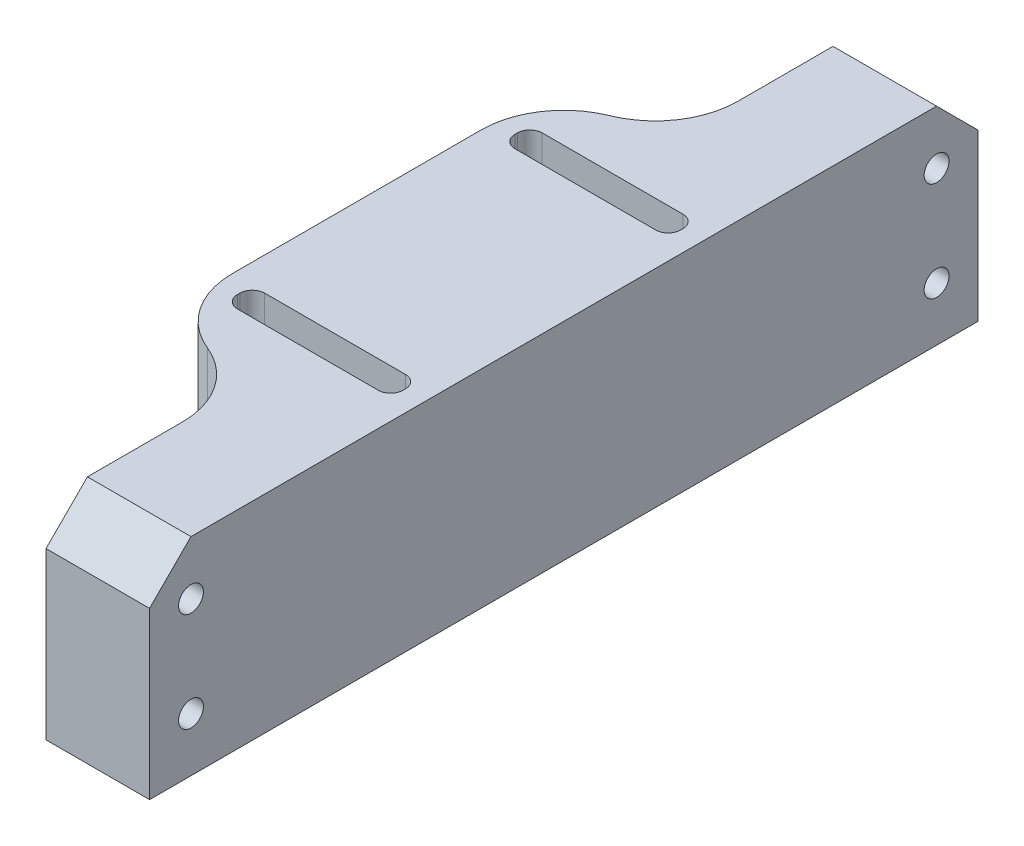
ISO-10303-21;
HEADER;
FILE_DESCRIPTION(('STEP AP214'),'2;1');
FILE_NAME('part.step','',(''),(''),'','','');
FILE_SCHEMA(('AUTOMOTIVE_DESIGN { 1 0 10303 214 1 1 1 1 }'));
ENDSEC;
DATA;
#1=APPLICATION_CONTEXT('core data for automotive mechanical design processes');
#2=APPLICATION_PROTOCOL_DEFINITION('international standard','automotive_design',2000,#1);
#3=PRODUCT_CONTEXT('',#1,'mechanical');
#4=PRODUCT('Part','Part','',(#3));
#5=PRODUCT_RELATED_PRODUCT_CATEGORY('part','',(#4));
#6=PRODUCT_DEFINITION_FORMATION('','',#4);
#7=PRODUCT_DEFINITION_CONTEXT('part definition',#1,'design');
#8=PRODUCT_DEFINITION('design','',#6,#7);
#9=PRODUCT_DEFINITION_SHAPE('','',#8);
#10=(LENGTH_UNIT() NAMED_UNIT(*) SI_UNIT(.MILLI.,.METRE.));
#11=(NAMED_UNIT(*) PLANE_ANGLE_UNIT() SI_UNIT($,.RADIAN.));
#12=(NAMED_UNIT(*) SI_UNIT($,.STERADIAN.) SOLID_ANGLE_UNIT());
#13=UNCERTAINTY_MEASURE_WITH_UNIT(LENGTH_MEASURE(1.E-05),#10,'distance_accuracy_value','');
#14=(GEOMETRIC_REPRESENTATION_CONTEXT(3) GLOBAL_UNCERTAINTY_ASSIGNED_CONTEXT((#13)) GLOBAL_UNIT_ASSIGNED_CONTEXT((#10,
#11,#12)) REPRESENTATION_CONTEXT('',''));
#15=CARTESIAN_POINT('',(0.,0.,0.));
#16=DIRECTION('',(0.,0.,1.));
#17=DIRECTION('',(1.,0.,0.));
#18=AXIS2_PLACEMENT_3D('',#15,#16,#17);
#19=CARTESIAN_POINT('',(0.,25.,0.));
#20=DIRECTION('',(0.,-1.,0.));
#21=DIRECTION('',(0.,0.,-1.));
#22=AXIS2_PLACEMENT_3D('',#19,#20,#21);
#23=PLANE('',#22);
#24=DIRECTION('',(0.,0.,1.));
#25=VECTOR('',#24,1.);
#26=CARTESIAN_POINT('',(-10.,25.,-15.1));
#27=LINE('',#26,#25);
#28=CARTESIAN_POINT('',(-10.,25.,-16.9));
#29=VERTEX_POINT('',#28);
#30=CARTESIAN_POINT('',(-10.,25.,-16.6));
#31=VERTEX_POINT('',#30);
#32=EDGE_CURVE('E428',#29,#31,#27,.T.);
#33=ORIENTED_EDGE('',*,*,#32,.F.);
#34=CARTESIAN_POINT('',(-8.5,25.,-16.9));
#35=DIRECTION('',(0.,-1.,0.));
#36=DIRECTION('',(0.,0.,-1.));
#37=AXIS2_PLACEMENT_3D('',#34,#35,#36);
#38=CIRCLE('',#37,1.5);
#39=CARTESIAN_POINT('',(-8.5,25.,-18.4));
#40=VERTEX_POINT('',#39);
#41=EDGE_CURVE('E347',#29,#40,#38,.T.);
#42=ORIENTED_EDGE('',*,*,#41,.T.);
#43=DIRECTION('',(-1.,0.,0.));
#44=VECTOR('',#43,1.);
#45=CARTESIAN_POINT('',(10.,25.,-18.4));
#46=LINE('',#45,#44);
#47=CARTESIAN_POINT('',(8.5,25.,-18.4));
#48=VERTEX_POINT('',#47);
#49=EDGE_CURVE('E406',#48,#40,#46,.T.);
#50=ORIENTED_EDGE('',*,*,#49,.F.);
#51=CARTESIAN_POINT('',(8.5,25.,-16.9));
#52=DIRECTION('',(0.,-1.,0.));
#53=DIRECTION('',(0.,0.,-1.));
#54=AXIS2_PLACEMENT_3D('',#51,#52,#53);
#55=CIRCLE('',#54,1.5);
#56=CARTESIAN_POINT('',(10.,25.,-16.9));
#57=VERTEX_POINT('',#56);
#58=EDGE_CURVE('E339',#48,#57,#55,.T.);
#59=ORIENTED_EDGE('',*,*,#58,.T.);
#60=DIRECTION('',(0.,0.,-1.));
#61=VECTOR('',#60,1.);
#62=CARTESIAN_POINT('',(10.,25.,-15.1));
#63=LINE('',#62,#61);
#64=CARTESIAN_POINT('',(10.,25.,-16.6));
#65=VERTEX_POINT('',#64);
#66=EDGE_CURVE('E408',#65,#57,#63,.T.);
#67=ORIENTED_EDGE('',*,*,#66,.F.);
#68=CARTESIAN_POINT('',(8.5,25.,-16.6));
#69=DIRECTION('',(0.,-1.,0.));
#70=DIRECTION('',(0.,0.,-1.));
#71=AXIS2_PLACEMENT_3D('',#68,#69,#70);
#72=CIRCLE('',#71,1.5);
#73=CARTESIAN_POINT('',(8.5,25.,-15.1));
#74=VERTEX_POINT('',#73);
#75=EDGE_CURVE('E335',#65,#74,#72,.T.);
#76=ORIENTED_EDGE('',*,*,#75,.T.);
#77=DIRECTION('',(1.,0.,0.));
#78=VECTOR('',#77,1.);
#79=CARTESIAN_POINT('',(10.,25.,-15.1));
#80=LINE('',#79,#78);
#81=CARTESIAN_POINT('',(-8.5,25.,-15.1));
#82=VERTEX_POINT('',#81);
#83=EDGE_CURVE('E414',#82,#74,#80,.T.);
#84=ORIENTED_EDGE('',*,*,#83,.F.);
#85=CARTESIAN_POINT('',(-8.5,25.,-16.6));
#86=DIRECTION('',(0.,-1.,0.));
#87=DIRECTION('',(0.,0.,-1.));
#88=AXIS2_PLACEMENT_3D('',#85,#86,#87);
#89=CIRCLE('',#88,1.5);
#90=EDGE_CURVE('E343',#82,#31,#89,.T.);
#91=ORIENTED_EDGE('',*,*,#90,.T.);
#92=EDGE_LOOP('',(#33,#42,#50,#59,#67,#76,#84,#91));
#93=FACE_BOUND('',#92,.T.);
#94=CARTESIAN_POINT('',(-2.5,25.,15.));
#95=DIRECTION('',(0.,-1.,0.));
#96=DIRECTION('',(0.,0.,-1.));
#97=AXIS2_PLACEMENT_3D('',#94,#95,#96);
#98=CIRCLE('',#97,10.);
#99=CARTESIAN_POINT('',(-12.5,25.,15.));
#100=VERTEX_POINT('',#99);
#101=CARTESIAN_POINT('',(-6.25,25.,24.2702481088696));
#102=VERTEX_POINT('',#101);
#103=EDGE_CURVE('E274',#100,#102,#98,.F.);
#104=ORIENTED_EDGE('',*,*,#103,.T.);
#105=CARTESIAN_POINT('',(-9.99999999999999,25.,33.5404962177392));
#106=DIRECTION('',(0.,-1.,0.));
#107=DIRECTION('',(0.,0.,-1.));
#108=AXIS2_PLACEMENT_3D('',#105,#106,#107);
#109=CIRCLE('',#108,10.);
#110=CARTESIAN_POINT('',(0.,25.,33.5404962177392));
#111=VERTEX_POINT('',#110);
#112=EDGE_CURVE('E375',#102,#111,#109,.T.);
#113=ORIENTED_EDGE('',*,*,#112,.T.);
#114=DIRECTION('',(0.,0.,1.));
#115=VECTOR('',#114,1.);
#116=CARTESIAN_POINT('',(0.,25.,25.));
#117=LINE('',#116,#115);
#118=CARTESIAN_POINT('',(0.,25.,45.));
#119=VERTEX_POINT('',#118);
#120=EDGE_CURVE('E379',#111,#119,#117,.T.);
#121=ORIENTED_EDGE('',*,*,#120,.T.);
#122=DIRECTION('',(1.,0.,0.));
#123=VECTOR('',#122,1.);
#124=CARTESIAN_POINT('',(0.,25.,45.));
#125=LINE('',#124,#123);
#126=CARTESIAN_POINT('',(12.5,25.,45.));
#127=VERTEX_POINT('',#126);
#128=EDGE_CURVE('E352',#119,#127,#125,.T.);
#129=ORIENTED_EDGE('',*,*,#128,.T.);
#130=DIRECTION('',(0.,0.,-1.));
#131=VECTOR('',#130,1.);
#132=CARTESIAN_POINT('',(12.5,25.,50.));
#133=LINE('',#132,#131);
#134=CARTESIAN_POINT('',(12.5,25.,-45.));
#135=VERTEX_POINT('',#134);
#136=EDGE_CURVE('E385',#127,#135,#133,.T.);
#137=ORIENTED_EDGE('',*,*,#136,.T.);
#138=DIRECTION('',(-1.,0.,0.));
#139=VECTOR('',#138,1.);
#140=CARTESIAN_POINT('',(0.,25.,-45.));
#141=LINE('',#140,#139);
#142=CARTESIAN_POINT('',(0.,25.,-45.));
#143=VERTEX_POINT('',#142);
#144=EDGE_CURVE('E349',#135,#143,#141,.T.);
#145=ORIENTED_EDGE('',*,*,#144,.T.);
#146=DIRECTION('',(0.,0.,1.));
#147=VECTOR('',#146,1.);
#148=CARTESIAN_POINT('',(0.,25.,-25.));
#149=LINE('',#148,#147);
#150=CARTESIAN_POINT('',(0.,25.,-33.5404962177392));
#151=VERTEX_POINT('',#150);
#152=EDGE_CURVE('E261',#143,#151,#149,.T.);
#153=ORIENTED_EDGE('',*,*,#152,.T.);
#154=CARTESIAN_POINT('',(-9.99999999999999,25.,-33.5404962177392));
#155=DIRECTION('',(0.,-1.,0.));
#156=DIRECTION('',(0.,0.,-1.));
#157=AXIS2_PLACEMENT_3D('',#154,#155,#156);
#158=CIRCLE('',#157,10.);
#159=CARTESIAN_POINT('',(-6.25,25.,-24.2702481088696));
#160=VERTEX_POINT('',#159);
#161=EDGE_CURVE('E11',#151,#160,#158,.T.);
#162=ORIENTED_EDGE('',*,*,#161,.T.);
#163=CARTESIAN_POINT('',(-2.5,25.,-15.));
#164=DIRECTION('',(0.,-1.,0.));
#165=DIRECTION('',(0.,0.,-1.));
#166=AXIS2_PLACEMENT_3D('',#163,#164,#165);
#167=CIRCLE('',#166,10.);
#168=CARTESIAN_POINT('',(-12.5,25.,-15.));
#169=VERTEX_POINT('',#168);
#170=EDGE_CURVE('E272',#160,#169,#167,.F.);
#171=ORIENTED_EDGE('',*,*,#170,.T.);
#172=DIRECTION('',(0.,0.,1.));
#173=VECTOR('',#172,1.);
#174=CARTESIAN_POINT('',(-12.5,25.,25.));
#175=LINE('',#174,#173);
#176=EDGE_CURVE('E257',#169,#100,#175,.T.);
#177=ORIENTED_EDGE('',*,*,#176,.T.);
#178=EDGE_LOOP('',(#104,#113,#121,#129,#137,#145,#153,#162,#171,#177));
#179=FACE_BOUND('',#178,.T.);
#180=DIRECTION('',(0.,0.,1.));
#181=VECTOR('',#180,1.);
#182=CARTESIAN_POINT('',(-10.,25.,18.4));
#183=LINE('',#182,#181);
#184=CARTESIAN_POINT('',(-10.,25.,16.6));
#185=VERTEX_POINT('',#184);
#186=CARTESIAN_POINT('',(-10.,25.,16.9));
#187=VERTEX_POINT('',#186);
#188=EDGE_CURVE('E440',#185,#187,#183,.T.);
#189=ORIENTED_EDGE('',*,*,#188,.F.);
#190=CARTESIAN_POINT('',(-8.50000000000001,25.,16.6));
#191=DIRECTION('',(0.,-1.,0.));
#192=DIRECTION('',(0.,0.,-1.));
#193=AXIS2_PLACEMENT_3D('',#190,#191,#192);
#194=CIRCLE('',#193,1.5);
#195=CARTESIAN_POINT('',(-8.50000000000001,25.,15.1));
#196=VERTEX_POINT('',#195);
#197=EDGE_CURVE('E323',#185,#196,#194,.T.);
#198=ORIENTED_EDGE('',*,*,#197,.T.);
#199=DIRECTION('',(-1.,0.,0.));
#200=VECTOR('',#199,1.);
#201=CARTESIAN_POINT('',(9.99999999999999,25.,15.1));
#202=LINE('',#201,#200);
#203=CARTESIAN_POINT('',(8.49999999999999,25.,15.1));
#204=VERTEX_POINT('',#203);
#205=EDGE_CURVE('E422',#204,#196,#202,.T.);
#206=ORIENTED_EDGE('',*,*,#205,.F.);
#207=CARTESIAN_POINT('',(8.49999999999999,25.,16.6));
#208=DIRECTION('',(0.,-1.,0.));
#209=DIRECTION('',(0.,0.,-1.));
#210=AXIS2_PLACEMENT_3D('',#207,#208,#209);
#211=CIRCLE('',#210,1.5);
#212=CARTESIAN_POINT('',(9.99999999999999,25.,16.6));
#213=VERTEX_POINT('',#212);
#214=EDGE_CURVE('E327',#204,#213,#211,.T.);
#215=ORIENTED_EDGE('',*,*,#214,.T.);
#216=DIRECTION('',(0.,0.,-1.));
#217=VECTOR('',#216,1.);
#218=CARTESIAN_POINT('',(9.99999999999999,25.,18.4));
#219=LINE('',#218,#217);
#220=CARTESIAN_POINT('',(9.99999999999999,25.,16.9));
#221=VERTEX_POINT('',#220);
#222=EDGE_CURVE('E453',#221,#213,#219,.T.);
#223=ORIENTED_EDGE('',*,*,#222,.F.);
#224=CARTESIAN_POINT('',(8.49999999999999,25.,16.9));
#225=DIRECTION('',(0.,-1.,0.));
#226=DIRECTION('',(0.,0.,-1.));
#227=AXIS2_PLACEMENT_3D('',#224,#225,#226);
#228=CIRCLE('',#227,1.5);
#229=CARTESIAN_POINT('',(8.49999999999999,25.,18.4));
#230=VERTEX_POINT('',#229);
#231=EDGE_CURVE('E331',#221,#230,#228,.T.);
#232=ORIENTED_EDGE('',*,*,#231,.T.);
#233=DIRECTION('',(1.,0.,0.));
#234=VECTOR('',#233,1.);
#235=CARTESIAN_POINT('',(9.99999999999999,25.,18.4));
#236=LINE('',#235,#234);
#237=CARTESIAN_POINT('',(-8.50000000000001,25.,18.4));
#238=VERTEX_POINT('',#237);
#239=EDGE_CURVE('E456',#238,#230,#236,.T.);
#240=ORIENTED_EDGE('',*,*,#239,.F.);
#241=CARTESIAN_POINT('',(-8.50000000000001,25.,16.9));
#242=DIRECTION('',(0.,-1.,0.));
#243=DIRECTION('',(0.,0.,-1.));
#244=AXIS2_PLACEMENT_3D('',#241,#242,#243);
#245=CIRCLE('',#244,1.5);
#246=EDGE_CURVE('E319',#238,#187,#245,.T.);
#247=ORIENTED_EDGE('',*,*,#246,.T.);
#248=EDGE_LOOP('',(#189,#198,#206,#215,#223,#232,#240,#247));
#249=FACE_BOUND('',#248,.T.);
#250=ADVANCED_FACE('F34',(#93,#179,#249),#23,.F.);
#251=CARTESIAN_POINT('',(0.,0.,0.));
#252=DIRECTION('',(0.,-1.,0.));
#253=DIRECTION('',(0.,0.,-1.));
#254=AXIS2_PLACEMENT_3D('',#251,#252,#253);
#255=PLANE('',#254);
#256=DIRECTION('',(0.,0.,1.));
#257=VECTOR('',#256,1.);
#258=CARTESIAN_POINT('',(0.,0.,25.));
#259=LINE('',#258,#257);
#260=CARTESIAN_POINT('',(0.,0.,33.5404962177392));
#261=VERTEX_POINT('',#260);
#262=CARTESIAN_POINT('',(0.,0.,50.));
#263=VERTEX_POINT('',#262);
#264=EDGE_CURVE('E220',#261,#263,#259,.T.);
#265=ORIENTED_EDGE('',*,*,#264,.F.);
#266=CARTESIAN_POINT('',(-9.99999999999999,0.,33.5404962177392));
#267=DIRECTION('',(0.,-1.,0.));
#268=DIRECTION('',(0.,0.,-1.));
#269=AXIS2_PLACEMENT_3D('',#266,#267,#268);
#270=CIRCLE('',#269,10.);
#271=CARTESIAN_POINT('',(-6.25,0.,24.2702481088696));
#272=VERTEX_POINT('',#271);
#273=EDGE_CURVE('E373',#261,#272,#270,.F.);
#274=ORIENTED_EDGE('',*,*,#273,.T.);
#275=CARTESIAN_POINT('',(-2.5,0.,15.));
#276=DIRECTION('',(0.,-1.,0.));
#277=DIRECTION('',(0.,0.,-1.));
#278=AXIS2_PLACEMENT_3D('',#275,#276,#277);
#279=CIRCLE('',#278,10.);
#280=CARTESIAN_POINT('',(-12.5,0.,15.));
#281=VERTEX_POINT('',#280);
#282=EDGE_CURVE('E265',#272,#281,#279,.T.);
#283=ORIENTED_EDGE('',*,*,#282,.T.);
#284=DIRECTION('',(0.,0.,1.));
#285=VECTOR('',#284,1.);
#286=CARTESIAN_POINT('',(-12.5,0.,25.));
#287=LINE('',#286,#285);
#288=CARTESIAN_POINT('',(-12.5,0.,-15.));
#289=VERTEX_POINT('',#288);
#290=EDGE_CURVE('E231',#289,#281,#287,.T.);
#291=ORIENTED_EDGE('',*,*,#290,.F.);
#292=CARTESIAN_POINT('',(-2.5,0.,-15.));
#293=DIRECTION('',(0.,-1.,0.));
#294=DIRECTION('',(0.,0.,-1.));
#295=AXIS2_PLACEMENT_3D('',#292,#293,#294);
#296=CIRCLE('',#295,10.);
#297=CARTESIAN_POINT('',(-6.25,0.,-24.2702481088696));
#298=VERTEX_POINT('',#297);
#299=EDGE_CURVE('E240',#289,#298,#296,.T.);
#300=ORIENTED_EDGE('',*,*,#299,.T.);
#301=CARTESIAN_POINT('',(-9.99999999999999,0.,-33.5404962177392));
#302=DIRECTION('',(0.,-1.,0.));
#303=DIRECTION('',(0.,0.,-1.));
#304=AXIS2_PLACEMENT_3D('',#301,#302,#303);
#305=CIRCLE('',#304,10.);
#306=CARTESIAN_POINT('',(0.,0.,-33.5404962177392));
#307=VERTEX_POINT('',#306);
#308=EDGE_CURVE('E42',#298,#307,#305,.F.);
#309=ORIENTED_EDGE('',*,*,#308,.T.);
#310=DIRECTION('',(0.,0.,1.));
#311=VECTOR('',#310,1.);
#312=CARTESIAN_POINT('',(0.,0.,-25.));
#313=LINE('',#312,#311);
#314=CARTESIAN_POINT('',(0.,0.,-50.));
#315=VERTEX_POINT('',#314);
#316=EDGE_CURVE('E255',#315,#307,#313,.T.);
#317=ORIENTED_EDGE('',*,*,#316,.F.);
#318=DIRECTION('',(-1.,0.,0.));
#319=VECTOR('',#318,1.);
#320=CARTESIAN_POINT('',(0.,0.,-50.));
#321=LINE('',#320,#319);
#322=CARTESIAN_POINT('',(12.5,0.,-50.));
#323=VERTEX_POINT('',#322);
#324=EDGE_CURVE('E249',#323,#315,#321,.T.);
#325=ORIENTED_EDGE('',*,*,#324,.F.);
#326=DIRECTION('',(0.,0.,-1.));
#327=VECTOR('',#326,1.);
#328=CARTESIAN_POINT('',(12.5,0.,50.));
#329=LINE('',#328,#327);
#330=CARTESIAN_POINT('',(12.5,0.,50.));
#331=VERTEX_POINT('',#330);
#332=EDGE_CURVE('E247',#331,#323,#329,.T.);
#333=ORIENTED_EDGE('',*,*,#332,.F.);
#334=DIRECTION('',(1.,0.,0.));
#335=VECTOR('',#334,1.);
#336=CARTESIAN_POINT('',(0.,0.,50.));
#337=LINE('',#336,#335);
#338=EDGE_CURVE('E230',#263,#331,#337,.T.);
#339=ORIENTED_EDGE('',*,*,#338,.F.);
#340=EDGE_LOOP('',(#265,#274,#283,#291,#300,#309,#317,#325,#333,#339));
#341=FACE_BOUND('',#340,.T.);
#342=DIRECTION('',(0.,0.,-1.));
#343=VECTOR('',#342,1.);
#344=CARTESIAN_POINT('',(10.,0.,-15.1));
#345=LINE('',#344,#343);
#346=CARTESIAN_POINT('',(10.,0.,-16.6));
#347=VERTEX_POINT('',#346);
#348=CARTESIAN_POINT('',(10.,0.,-16.9));
#349=VERTEX_POINT('',#348);
#350=EDGE_CURVE('E424',#347,#349,#345,.T.);
#351=ORIENTED_EDGE('',*,*,#350,.T.);
#352=CARTESIAN_POINT('',(8.5,0.,-16.9));
#353=DIRECTION('',(0.,-1.,0.));
#354=DIRECTION('',(0.,0.,-1.));
#355=AXIS2_PLACEMENT_3D('',#352,#353,#354);
#356=CIRCLE('',#355,1.5);
#357=CARTESIAN_POINT('',(8.5,0.,-18.4));
#358=VERTEX_POINT('',#357);
#359=EDGE_CURVE('E337',#349,#358,#356,.F.);
#360=ORIENTED_EDGE('',*,*,#359,.T.);
#361=DIRECTION('',(-1.,0.,0.));
#362=VECTOR('',#361,1.);
#363=CARTESIAN_POINT('',(10.,0.,-18.4));
#364=LINE('',#363,#362);
#365=CARTESIAN_POINT('',(-8.5,0.,-18.4));
#366=VERTEX_POINT('',#365);
#367=EDGE_CURVE('E401',#358,#366,#364,.T.);
#368=ORIENTED_EDGE('',*,*,#367,.T.);
#369=CARTESIAN_POINT('',(-8.5,0.,-16.9));
#370=DIRECTION('',(0.,-1.,0.));
#371=DIRECTION('',(0.,0.,-1.));
#372=AXIS2_PLACEMENT_3D('',#369,#370,#371);
#373=CIRCLE('',#372,1.5);
#374=CARTESIAN_POINT('',(-10.,0.,-16.9));
#375=VERTEX_POINT('',#374);
#376=EDGE_CURVE('E345',#366,#375,#373,.F.);
#377=ORIENTED_EDGE('',*,*,#376,.T.);
#378=DIRECTION('',(0.,0.,1.));
#379=VECTOR('',#378,1.);
#380=CARTESIAN_POINT('',(-10.,0.,-15.1));
#381=LINE('',#380,#379);
#382=CARTESIAN_POINT('',(-10.,0.,-16.6));
#383=VERTEX_POINT('',#382);
#384=EDGE_CURVE('E418',#375,#383,#381,.T.);
#385=ORIENTED_EDGE('',*,*,#384,.T.);
#386=CARTESIAN_POINT('',(-8.5,0.,-16.6));
#387=DIRECTION('',(0.,-1.,0.));
#388=DIRECTION('',(0.,0.,-1.));
#389=AXIS2_PLACEMENT_3D('',#386,#387,#388);
#390=CIRCLE('',#389,1.5);
#391=CARTESIAN_POINT('',(-8.5,0.,-15.1));
#392=VERTEX_POINT('',#391);
#393=EDGE_CURVE('E341',#383,#392,#390,.F.);
#394=ORIENTED_EDGE('',*,*,#393,.T.);
#395=DIRECTION('',(1.,0.,0.));
#396=VECTOR('',#395,1.);
#397=CARTESIAN_POINT('',(10.,0.,-15.1));
#398=LINE('',#397,#396);
#399=CARTESIAN_POINT('',(8.5,0.,-15.1));
#400=VERTEX_POINT('',#399);
#401=EDGE_CURVE('E421',#392,#400,#398,.T.);
#402=ORIENTED_EDGE('',*,*,#401,.T.);
#403=CARTESIAN_POINT('',(8.5,0.,-16.6));
#404=DIRECTION('',(0.,-1.,0.));
#405=DIRECTION('',(0.,0.,-1.));
#406=AXIS2_PLACEMENT_3D('',#403,#404,#405);
#407=CIRCLE('',#406,1.5);
#408=EDGE_CURVE('E333',#400,#347,#407,.F.);
#409=ORIENTED_EDGE('',*,*,#408,.T.);
#410=EDGE_LOOP('',(#351,#360,#368,#377,#385,#394,#402,#409));
#411=FACE_BOUND('',#410,.T.);
#412=DIRECTION('',(0.,0.,-1.));
#413=VECTOR('',#412,1.);
#414=CARTESIAN_POINT('',(9.99999999999999,0.,18.4));
#415=LINE('',#414,#413);
#416=CARTESIAN_POINT('',(9.99999999999999,0.,16.9));
#417=VERTEX_POINT('',#416);
#418=CARTESIAN_POINT('',(9.99999999999999,0.,16.6));
#419=VERTEX_POINT('',#418);
#420=EDGE_CURVE('E441',#417,#419,#415,.T.);
#421=ORIENTED_EDGE('',*,*,#420,.T.);
#422=CARTESIAN_POINT('',(8.49999999999999,0.,16.6));
#423=DIRECTION('',(0.,-1.,0.));
#424=DIRECTION('',(0.,0.,-1.));
#425=AXIS2_PLACEMENT_3D('',#422,#423,#424);
#426=CIRCLE('',#425,1.5);
#427=CARTESIAN_POINT('',(8.49999999999999,0.,15.1));
#428=VERTEX_POINT('',#427);
#429=EDGE_CURVE('E325',#419,#428,#426,.F.);
#430=ORIENTED_EDGE('',*,*,#429,.T.);
#431=DIRECTION('',(-1.,0.,0.));
#432=VECTOR('',#431,1.);
#433=CARTESIAN_POINT('',(9.99999999999999,0.,15.1));
#434=LINE('',#433,#432);
#435=CARTESIAN_POINT('',(-8.50000000000001,0.,15.1));
#436=VERTEX_POINT('',#435);
#437=EDGE_CURVE('E437',#428,#436,#434,.T.);
#438=ORIENTED_EDGE('',*,*,#437,.T.);
#439=CARTESIAN_POINT('',(-8.50000000000001,0.,16.6));
#440=DIRECTION('',(0.,-1.,0.));
#441=DIRECTION('',(0.,0.,-1.));
#442=AXIS2_PLACEMENT_3D('',#439,#440,#441);
#443=CIRCLE('',#442,1.5);
#444=CARTESIAN_POINT('',(-10.,0.,16.6));
#445=VERTEX_POINT('',#444);
#446=EDGE_CURVE('E321',#436,#445,#443,.F.);
#447=ORIENTED_EDGE('',*,*,#446,.T.);
#448=DIRECTION('',(0.,0.,1.));
#449=VECTOR('',#448,1.);
#450=CARTESIAN_POINT('',(-10.,0.,18.4));
#451=LINE('',#450,#449);
#452=CARTESIAN_POINT('',(-10.,0.,16.9));
#453=VERTEX_POINT('',#452);
#454=EDGE_CURVE('E447',#445,#453,#451,.T.);
#455=ORIENTED_EDGE('',*,*,#454,.T.);
#456=CARTESIAN_POINT('',(-8.50000000000001,0.,16.9));
#457=DIRECTION('',(0.,-1.,0.));
#458=DIRECTION('',(0.,0.,-1.));
#459=AXIS2_PLACEMENT_3D('',#456,#457,#458);
#460=CIRCLE('',#459,1.5);
#461=CARTESIAN_POINT('',(-8.50000000000001,0.,18.4));
#462=VERTEX_POINT('',#461);
#463=EDGE_CURVE('E317',#453,#462,#460,.F.);
#464=ORIENTED_EDGE('',*,*,#463,.T.);
#465=DIRECTION('',(1.,0.,0.));
#466=VECTOR('',#465,1.);
#467=CARTESIAN_POINT('',(9.99999999999999,0.,18.4));
#468=LINE('',#467,#466);
#469=CARTESIAN_POINT('',(8.49999999999999,0.,18.4));
#470=VERTEX_POINT('',#469);
#471=EDGE_CURVE('E444',#462,#470,#468,.T.);
#472=ORIENTED_EDGE('',*,*,#471,.T.);
#473=CARTESIAN_POINT('',(8.49999999999999,0.,16.9));
#474=DIRECTION('',(0.,-1.,0.));
#475=DIRECTION('',(0.,0.,-1.));
#476=AXIS2_PLACEMENT_3D('',#473,#474,#475);
#477=CIRCLE('',#476,1.5);
#478=EDGE_CURVE('E329',#470,#417,#477,.F.);
#479=ORIENTED_EDGE('',*,*,#478,.T.);
#480=EDGE_LOOP('',(#421,#430,#438,#447,#455,#464,#472,#479));
#481=FACE_BOUND('',#480,.T.);
#482=ADVANCED_FACE('F243',(#341,#411,#481),#255,.T.);
#483=CARTESIAN_POINT('',(-12.5,25.,25.));
#484=DIRECTION('',(1.,0.,0.));
#485=DIRECTION('',(0.,0.,-1.));
#486=AXIS2_PLACEMENT_3D('',#483,#484,#485);
#487=PLANE('',#486);
#488=ORIENTED_EDGE('',*,*,#290,.T.);
#489=DIRECTION('',(0.,-1.,0.));
#490=VECTOR('',#489,1.);
#491=CARTESIAN_POINT('',(-12.5,25.,15.));
#492=LINE('',#491,#490);
#493=EDGE_CURVE('E270',#281,#100,#492,.F.);
#494=ORIENTED_EDGE('',*,*,#493,.T.);
#495=ORIENTED_EDGE('',*,*,#176,.F.);
#496=DIRECTION('',(0.,-1.,0.));
#497=VECTOR('',#496,1.);
#498=CARTESIAN_POINT('',(-12.5,25.,-15.));
#499=LINE('',#498,#497);
#500=EDGE_CURVE('E267',#169,#289,#499,.T.);
#501=ORIENTED_EDGE('',*,*,#500,.T.);
#502=EDGE_LOOP('',(#488,#494,#495,#501));
#503=FACE_BOUND('',#502,.T.);
#504=ADVANCED_FACE('F396',(#503),#487,.F.);
#505=CARTESIAN_POINT('',(0.,25.,25.));
#506=DIRECTION('',(1.,0.,0.));
#507=DIRECTION('',(0.,0.,-1.));
#508=AXIS2_PLACEMENT_3D('',#505,#506,#507);
#509=PLANE('',#508);
#510=CARTESIAN_POINT('',(0.,18.5,45.));
#511=DIRECTION('',(-1.,0.,0.));
#512=DIRECTION('',(0.,0.,1.));
#513=AXIS2_PLACEMENT_3D('',#510,#511,#512);
#514=CIRCLE('',#513,1.5);
#515=CARTESIAN_POINT('',(0.,18.5,46.5));
#516=VERTEX_POINT('',#515);
#517=EDGE_CURVE('E479',#516,#516,#514,.T.);
#518=ORIENTED_EDGE('',*,*,#517,.F.);
#519=EDGE_LOOP('',(#518));
#520=FACE_BOUND('',#519,.T.);
#521=CARTESIAN_POINT('',(0.,6.5,45.));
#522=DIRECTION('',(-1.,0.,0.));
#523=DIRECTION('',(0.,0.,1.));
#524=AXIS2_PLACEMENT_3D('',#521,#522,#523);
#525=CIRCLE('',#524,1.5);
#526=CARTESIAN_POINT('',(0.,6.5,46.5));
#527=VERTEX_POINT('',#526);
#528=EDGE_CURVE('E473',#527,#527,#525,.T.);
#529=ORIENTED_EDGE('',*,*,#528,.F.);
#530=EDGE_LOOP('',(#529));
#531=FACE_BOUND('',#530,.T.);
#532=ORIENTED_EDGE('',*,*,#120,.F.);
#533=DIRECTION('',(0.,-1.,0.));
#534=VECTOR('',#533,1.);
#535=CARTESIAN_POINT('',(0.,25.,33.5404962177392));
#536=LINE('',#535,#534);
#537=EDGE_CURVE('E228',#111,#261,#536,.T.);
#538=ORIENTED_EDGE('',*,*,#537,.T.);
#539=ORIENTED_EDGE('',*,*,#264,.T.);
#540=DIRECTION('',(0.,-1.,0.));
#541=VECTOR('',#540,1.);
#542=CARTESIAN_POINT('',(0.,25.,50.));
#543=LINE('',#542,#541);
#544=CARTESIAN_POINT('',(0.,20.,50.));
#545=VERTEX_POINT('',#544);
#546=EDGE_CURVE('E225',#545,#263,#543,.T.);
#547=ORIENTED_EDGE('',*,*,#546,.F.);
#548=DIRECTION('',(0.,-0.70710678118655,0.707106781186546));
#549=VECTOR('',#548,1.);
#550=CARTESIAN_POINT('',(0.,25.,45.));
#551=LINE('',#550,#549);
#552=EDGE_CURVE('E360',#545,#119,#551,.F.);
#553=ORIENTED_EDGE('',*,*,#552,.T.);
#554=EDGE_LOOP('',(#532,#538,#539,#547,#553));
#555=FACE_BOUND('',#554,.T.);
#556=ADVANCED_FACE('F223',(#520,#531,#555),#509,.F.);
#557=CARTESIAN_POINT('',(0.,25.,50.));
#558=DIRECTION('',(0.,0.,-1.));
#559=DIRECTION('',(-1.,0.,0.));
#560=AXIS2_PLACEMENT_3D('',#557,#558,#559);
#561=PLANE('',#560);
#562=DIRECTION('',(0.,-1.,0.));
#563=VECTOR('',#562,1.);
#564=CARTESIAN_POINT('',(12.5,25.,50.));
#565=LINE('',#564,#563);
#566=CARTESIAN_POINT('',(12.5,20.,50.));
#567=VERTEX_POINT('',#566);
#568=EDGE_CURVE('E241',#567,#331,#565,.T.);
#569=ORIENTED_EDGE('',*,*,#568,.F.);
#570=DIRECTION('',(-1.,0.,0.));
#571=VECTOR('',#570,1.);
#572=CARTESIAN_POINT('',(0.,20.,50.));
#573=LINE('',#572,#571);
#574=EDGE_CURVE('E239',#567,#545,#573,.T.);
#575=ORIENTED_EDGE('',*,*,#574,.T.);
#576=ORIENTED_EDGE('',*,*,#546,.T.);
#577=ORIENTED_EDGE('',*,*,#338,.T.);
#578=EDGE_LOOP('',(#569,#575,#576,#577));
#579=FACE_BOUND('',#578,.T.);
#580=ADVANCED_FACE('F236',(#579),#561,.F.);
#581=CARTESIAN_POINT('',(12.5,25.,50.));
#582=DIRECTION('',(-1.,0.,0.));
#583=DIRECTION('',(0.,0.,1.));
#584=AXIS2_PLACEMENT_3D('',#581,#582,#583);
#585=PLANE('',#584);
#586=CARTESIAN_POINT('',(12.5,18.5,45.));
#587=DIRECTION('',(-1.,0.,0.));
#588=DIRECTION('',(0.,0.,1.));
#589=AXIS2_PLACEMENT_3D('',#586,#587,#588);
#590=CIRCLE('',#589,1.5);
#591=CARTESIAN_POINT('',(12.5,18.5,46.5));
#592=VERTEX_POINT('',#591);
#593=EDGE_CURVE('E476',#592,#592,#590,.T.);
#594=ORIENTED_EDGE('',*,*,#593,.T.);
#595=EDGE_LOOP('',(#594));
#596=FACE_BOUND('',#595,.T.);
#597=CARTESIAN_POINT('',(12.5,6.5,45.));
#598=DIRECTION('',(-1.,0.,0.));
#599=DIRECTION('',(0.,0.,1.));
#600=AXIS2_PLACEMENT_3D('',#597,#598,#599);
#601=CIRCLE('',#600,1.5);
#602=CARTESIAN_POINT('',(12.5,6.5,46.5));
#603=VERTEX_POINT('',#602);
#604=EDGE_CURVE('E470',#603,#603,#601,.T.);
#605=ORIENTED_EDGE('',*,*,#604,.T.);
#606=EDGE_LOOP('',(#605));
#607=FACE_BOUND('',#606,.T.);
#608=CARTESIAN_POINT('',(12.5,18.5,-45.));
#609=DIRECTION('',(-1.,0.,0.));
#610=DIRECTION('',(0.,0.,1.));
#611=AXIS2_PLACEMENT_3D('',#608,#609,#610);
#612=CIRCLE('',#611,1.5);
#613=CARTESIAN_POINT('',(12.5,18.5,-43.5));
#614=VERTEX_POINT('',#613);
#615=EDGE_CURVE('E464',#614,#614,#612,.T.);
#616=ORIENTED_EDGE('',*,*,#615,.T.);
#617=EDGE_LOOP('',(#616));
#618=FACE_BOUND('',#617,.T.);
#619=CARTESIAN_POINT('',(12.5,6.5,-45.));
#620=DIRECTION('',(-1.,0.,0.));
#621=DIRECTION('',(0.,0.,1.));
#622=AXIS2_PLACEMENT_3D('',#619,#620,#621);
#623=CIRCLE('',#622,1.5);
#624=CARTESIAN_POINT('',(12.5,6.5,-43.5));
#625=VERTEX_POINT('',#624);
#626=EDGE_CURVE('E450',#625,#625,#623,.T.);
#627=ORIENTED_EDGE('',*,*,#626,.T.);
#628=EDGE_LOOP('',(#627));
#629=FACE_BOUND('',#628,.T.);
#630=ORIENTED_EDGE('',*,*,#136,.F.);
#631=DIRECTION('',(0.,0.707106781186549,-0.707106781186546));
#632=VECTOR('',#631,1.);
#633=CARTESIAN_POINT('',(12.5,25.,45.));
#634=LINE('',#633,#632);
#635=EDGE_CURVE('E357',#127,#567,#634,.F.);
#636=ORIENTED_EDGE('',*,*,#635,.T.);
#637=ORIENTED_EDGE('',*,*,#568,.T.);
#638=ORIENTED_EDGE('',*,*,#332,.T.);
#639=DIRECTION('',(0.,-1.,0.));
#640=VECTOR('',#639,1.);
#641=CARTESIAN_POINT('',(12.5,25.,-50.));
#642=LINE('',#641,#640);
#643=CARTESIAN_POINT('',(12.5,20.,-50.));
#644=VERTEX_POINT('',#643);
#645=EDGE_CURVE('E260',#644,#323,#642,.T.);
#646=ORIENTED_EDGE('',*,*,#645,.F.);
#647=DIRECTION('',(0.,-0.707106781186549,-0.707106781186546));
#648=VECTOR('',#647,1.);
#649=CARTESIAN_POINT('',(12.5,25.,-45.));
#650=LINE('',#649,#648);
#651=EDGE_CURVE('E355',#644,#135,#650,.F.);
#652=ORIENTED_EDGE('',*,*,#651,.T.);
#653=EDGE_LOOP('',(#630,#636,#637,#638,#646,#652));
#654=FACE_BOUND('',#653,.T.);
#655=ADVANCED_FACE('F485',(#596,#607,#618,#629,#654),#585,.F.);
#656=CARTESIAN_POINT('',(0.,25.,-50.));
#657=DIRECTION('',(0.,0.,1.));
#658=DIRECTION('',(1.,0.,0.));
#659=AXIS2_PLACEMENT_3D('',#656,#657,#658);
#660=PLANE('',#659);
#661=DIRECTION('',(0.,-1.,0.));
#662=VECTOR('',#661,1.);
#663=CARTESIAN_POINT('',(0.,25.,-50.));
#664=LINE('',#663,#662);
#665=CARTESIAN_POINT('',(0.,20.,-50.));
#666=VERTEX_POINT('',#665);
#667=EDGE_CURVE('E258',#666,#315,#664,.T.);
#668=ORIENTED_EDGE('',*,*,#667,.F.);
#669=DIRECTION('',(1.,0.,0.));
#670=VECTOR('',#669,1.);
#671=CARTESIAN_POINT('',(0.,20.,-50.));
#672=LINE('',#671,#670);
#673=EDGE_CURVE('E364',#666,#644,#672,.T.);
#674=ORIENTED_EDGE('',*,*,#673,.T.);
#675=ORIENTED_EDGE('',*,*,#645,.T.);
#676=ORIENTED_EDGE('',*,*,#324,.T.);
#677=EDGE_LOOP('',(#668,#674,#675,#676));
#678=FACE_BOUND('',#677,.T.);
#679=ADVANCED_FACE('F525',(#678),#660,.F.);
#680=CARTESIAN_POINT('',(0.,25.,-25.));
#681=DIRECTION('',(1.,0.,0.));
#682=DIRECTION('',(0.,0.,-1.));
#683=AXIS2_PLACEMENT_3D('',#680,#681,#682);
#684=PLANE('',#683);
#685=CARTESIAN_POINT('',(0.,18.5,-45.));
#686=DIRECTION('',(-1.,0.,0.));
#687=DIRECTION('',(0.,0.,1.));
#688=AXIS2_PLACEMENT_3D('',#685,#686,#687);
#689=CIRCLE('',#688,1.5);
#690=CARTESIAN_POINT('',(0.,18.5,-43.5));
#691=VERTEX_POINT('',#690);
#692=EDGE_CURVE('E467',#691,#691,#689,.T.);
#693=ORIENTED_EDGE('',*,*,#692,.F.);
#694=EDGE_LOOP('',(#693));
#695=FACE_BOUND('',#694,.T.);
#696=CARTESIAN_POINT('',(0.,6.5,-45.));
#697=DIRECTION('',(-1.,0.,0.));
#698=DIRECTION('',(0.,0.,1.));
#699=AXIS2_PLACEMENT_3D('',#696,#697,#698);
#700=CIRCLE('',#699,1.5);
#701=CARTESIAN_POINT('',(0.,6.5,-43.5));
#702=VERTEX_POINT('',#701);
#703=EDGE_CURVE('E461',#702,#702,#700,.T.);
#704=ORIENTED_EDGE('',*,*,#703,.F.);
#705=EDGE_LOOP('',(#704));
#706=FACE_BOUND('',#705,.T.);
#707=ORIENTED_EDGE('',*,*,#316,.T.);
#708=DIRECTION('',(0.,-1.,0.));
#709=VECTOR('',#708,1.);
#710=CARTESIAN_POINT('',(0.,25.,-33.5404962177392));
#711=LINE('',#710,#709);
#712=EDGE_CURVE('E55',#307,#151,#711,.F.);
#713=ORIENTED_EDGE('',*,*,#712,.T.);
#714=ORIENTED_EDGE('',*,*,#152,.F.);
#715=DIRECTION('',(0.,0.70710678118655,0.707106781186546));
#716=VECTOR('',#715,1.);
#717=CARTESIAN_POINT('',(0.,25.,-45.));
#718=LINE('',#717,#716);
#719=EDGE_CURVE('E362',#143,#666,#718,.F.);
#720=ORIENTED_EDGE('',*,*,#719,.T.);
#721=ORIENTED_EDGE('',*,*,#667,.T.);
#722=EDGE_LOOP('',(#707,#713,#714,#720,#721));
#723=FACE_BOUND('',#722,.T.);
#724=ADVANCED_FACE('F522',(#695,#706,#723),#684,.F.);
#725=CARTESIAN_POINT('',(-10.,25.,-15.1));
#726=DIRECTION('',(1.,0.,0.));
#727=DIRECTION('',(0.,0.,-1.));
#728=AXIS2_PLACEMENT_3D('',#725,#726,#727);
#729=PLANE('',#728);
#730=ORIENTED_EDGE('',*,*,#32,.T.);
#731=DIRECTION('',(0.,-1.,0.));
#732=VECTOR('',#731,1.);
#733=CARTESIAN_POINT('',(-10.,0.,-16.6));
#734=LINE('',#733,#732);
#735=EDGE_CURVE('E314',#31,#383,#734,.T.);
#736=ORIENTED_EDGE('',*,*,#735,.T.);
#737=ORIENTED_EDGE('',*,*,#384,.F.);
#738=DIRECTION('',(0.,-1.,0.));
#739=VECTOR('',#738,1.);
#740=CARTESIAN_POINT('',(-10.,25.,-16.9));
#741=LINE('',#740,#739);
#742=EDGE_CURVE('E312',#375,#29,#741,.F.);
#743=ORIENTED_EDGE('',*,*,#742,.T.);
#744=EDGE_LOOP('',(#730,#736,#737,#743));
#745=FACE_BOUND('',#744,.T.);
#746=ADVANCED_FACE('F519',(#745),#729,.T.);
#747=CARTESIAN_POINT('',(10.,25.,-15.1));
#748=DIRECTION('',(0.,0.,-1.));
#749=DIRECTION('',(-1.,0.,0.));
#750=AXIS2_PLACEMENT_3D('',#747,#748,#749);
#751=PLANE('',#750);
#752=ORIENTED_EDGE('',*,*,#83,.T.);
#753=DIRECTION('',(0.,-1.,0.));
#754=VECTOR('',#753,1.);
#755=CARTESIAN_POINT('',(8.5,0.,-15.1));
#756=LINE('',#755,#754);
#757=EDGE_CURVE('E299',#74,#400,#756,.T.);
#758=ORIENTED_EDGE('',*,*,#757,.T.);
#759=ORIENTED_EDGE('',*,*,#401,.F.);
#760=DIRECTION('',(0.,-1.,0.));
#761=VECTOR('',#760,1.);
#762=CARTESIAN_POINT('',(-8.5,25.,-15.1));
#763=LINE('',#762,#761);
#764=EDGE_CURVE('E297',#392,#82,#763,.F.);
#765=ORIENTED_EDGE('',*,*,#764,.T.);
#766=EDGE_LOOP('',(#752,#758,#759,#765));
#767=FACE_BOUND('',#766,.T.);
#768=ADVANCED_FACE('F778',(#767),#751,.T.);
#769=CARTESIAN_POINT('',(10.,25.,-15.1));
#770=DIRECTION('',(-1.,0.,0.));
#771=DIRECTION('',(0.,0.,1.));
#772=AXIS2_PLACEMENT_3D('',#769,#770,#771);
#773=PLANE('',#772);
#774=ORIENTED_EDGE('',*,*,#350,.F.);
#775=DIRECTION('',(0.,-1.,0.));
#776=VECTOR('',#775,1.);
#777=CARTESIAN_POINT('',(10.,25.,-16.6));
#778=LINE('',#777,#776);
#779=EDGE_CURVE('E305',#347,#65,#778,.F.);
#780=ORIENTED_EDGE('',*,*,#779,.T.);
#781=ORIENTED_EDGE('',*,*,#66,.T.);
#782=DIRECTION('',(0.,-1.,0.));
#783=VECTOR('',#782,1.);
#784=CARTESIAN_POINT('',(10.,0.,-16.9));
#785=LINE('',#784,#783);
#786=EDGE_CURVE('E302',#57,#349,#785,.T.);
#787=ORIENTED_EDGE('',*,*,#786,.T.);
#788=EDGE_LOOP('',(#774,#780,#781,#787));
#789=FACE_BOUND('',#788,.T.);
#790=ADVANCED_FACE('F769',(#789),#773,.T.);
#791=CARTESIAN_POINT('',(10.,25.,-18.4));
#792=DIRECTION('',(0.,0.,1.));
#793=DIRECTION('',(1.,0.,0.));
#794=AXIS2_PLACEMENT_3D('',#791,#792,#793);
#795=PLANE('',#794);
#796=ORIENTED_EDGE('',*,*,#367,.F.);
#797=DIRECTION('',(0.,-1.,0.));
#798=VECTOR('',#797,1.);
#799=CARTESIAN_POINT('',(8.5,25.,-18.4));
#800=LINE('',#799,#798);
#801=EDGE_CURVE('E310',#358,#48,#800,.F.);
#802=ORIENTED_EDGE('',*,*,#801,.T.);
#803=ORIENTED_EDGE('',*,*,#49,.T.);
#804=DIRECTION('',(0.,-1.,0.));
#805=VECTOR('',#804,1.);
#806=CARTESIAN_POINT('',(-8.5,0.,-18.4));
#807=LINE('',#806,#805);
#808=EDGE_CURVE('E307',#40,#366,#807,.T.);
#809=ORIENTED_EDGE('',*,*,#808,.T.);
#810=EDGE_LOOP('',(#796,#802,#803,#809));
#811=FACE_BOUND('',#810,.T.);
#812=ADVANCED_FACE('F759',(#811),#795,.T.);
#813=CARTESIAN_POINT('',(-10.,25.,18.4));
#814=DIRECTION('',(1.,0.,0.));
#815=DIRECTION('',(0.,0.,-1.));
#816=AXIS2_PLACEMENT_3D('',#813,#814,#815);
#817=PLANE('',#816);
#818=ORIENTED_EDGE('',*,*,#188,.T.);
#819=DIRECTION('',(0.,-1.,0.));
#820=VECTOR('',#819,1.);
#821=CARTESIAN_POINT('',(-10.,0.,16.9));
#822=LINE('',#821,#820);
#823=EDGE_CURVE('E279',#187,#453,#822,.T.);
#824=ORIENTED_EDGE('',*,*,#823,.T.);
#825=ORIENTED_EDGE('',*,*,#454,.F.);
#826=DIRECTION('',(0.,-1.,0.));
#827=VECTOR('',#826,1.);
#828=CARTESIAN_POINT('',(-10.,25.,16.6));
#829=LINE('',#828,#827);
#830=EDGE_CURVE('E277',#445,#185,#829,.F.);
#831=ORIENTED_EDGE('',*,*,#830,.T.);
#832=EDGE_LOOP('',(#818,#824,#825,#831));
#833=FACE_BOUND('',#832,.T.);
#834=ADVANCED_FACE('F749',(#833),#817,.T.);
#835=CARTESIAN_POINT('',(9.99999999999999,25.,18.4));
#836=DIRECTION('',(0.,0.,-1.));
#837=DIRECTION('',(-1.,0.,0.));
#838=AXIS2_PLACEMENT_3D('',#835,#836,#837);
#839=PLANE('',#838);
#840=ORIENTED_EDGE('',*,*,#471,.F.);
#841=DIRECTION('',(0.,-1.,0.));
#842=VECTOR('',#841,1.);
#843=CARTESIAN_POINT('',(-8.50000000000001,25.,18.4));
#844=LINE('',#843,#842);
#845=EDGE_CURVE('E285',#462,#238,#844,.F.);
#846=ORIENTED_EDGE('',*,*,#845,.T.);
#847=ORIENTED_EDGE('',*,*,#239,.T.);
#848=DIRECTION('',(0.,-1.,0.));
#849=VECTOR('',#848,1.);
#850=CARTESIAN_POINT('',(8.49999999999999,0.,18.4));
#851=LINE('',#850,#849);
#852=EDGE_CURVE('E282',#230,#470,#851,.T.);
#853=ORIENTED_EDGE('',*,*,#852,.T.);
#854=EDGE_LOOP('',(#840,#846,#847,#853));
#855=FACE_BOUND('',#854,.T.);
#856=ADVANCED_FACE('F739',(#855),#839,.T.);
#857=CARTESIAN_POINT('',(9.99999999999999,25.,18.4));
#858=DIRECTION('',(-1.,0.,0.));
#859=DIRECTION('',(0.,0.,1.));
#860=AXIS2_PLACEMENT_3D('',#857,#858,#859);
#861=PLANE('',#860);
#862=ORIENTED_EDGE('',*,*,#222,.T.);
#863=DIRECTION('',(0.,-1.,0.));
#864=VECTOR('',#863,1.);
#865=CARTESIAN_POINT('',(9.99999999999999,0.,16.6));
#866=LINE('',#865,#864);
#867=EDGE_CURVE('E294',#213,#419,#866,.T.);
#868=ORIENTED_EDGE('',*,*,#867,.T.);
#869=ORIENTED_EDGE('',*,*,#420,.F.);
#870=DIRECTION('',(0.,-1.,0.));
#871=VECTOR('',#870,1.);
#872=CARTESIAN_POINT('',(9.99999999999999,25.,16.9));
#873=LINE('',#872,#871);
#874=EDGE_CURVE('E292',#417,#221,#873,.F.);
#875=ORIENTED_EDGE('',*,*,#874,.T.);
#876=EDGE_LOOP('',(#862,#868,#869,#875));
#877=FACE_BOUND('',#876,.T.);
#878=ADVANCED_FACE('F727',(#877),#861,.T.);
#879=CARTESIAN_POINT('',(9.99999999999999,25.,15.1));
#880=DIRECTION('',(0.,0.,1.));
#881=DIRECTION('',(1.,0.,0.));
#882=AXIS2_PLACEMENT_3D('',#879,#880,#881);
#883=PLANE('',#882);
#884=ORIENTED_EDGE('',*,*,#205,.T.);
#885=DIRECTION('',(0.,-1.,0.));
#886=VECTOR('',#885,1.);
#887=CARTESIAN_POINT('',(-8.50000000000001,0.,15.1));
#888=LINE('',#887,#886);
#889=EDGE_CURVE('E289',#196,#436,#888,.T.);
#890=ORIENTED_EDGE('',*,*,#889,.T.);
#891=ORIENTED_EDGE('',*,*,#437,.F.);
#892=DIRECTION('',(0.,-1.,0.));
#893=VECTOR('',#892,1.);
#894=CARTESIAN_POINT('',(8.49999999999999,25.,15.1));
#895=LINE('',#894,#893);
#896=EDGE_CURVE('E287',#428,#204,#895,.F.);
#897=ORIENTED_EDGE('',*,*,#896,.T.);
#898=EDGE_LOOP('',(#884,#890,#891,#897));
#899=FACE_BOUND('',#898,.T.);
#900=ADVANCED_FACE('F722',(#899),#883,.T.);
#901=CARTESIAN_POINT('',(12.5,6.5,-45.));
#902=DIRECTION('',(-1.,0.,0.));
#903=DIRECTION('',(0.,0.,1.));
#904=AXIS2_PLACEMENT_3D('',#901,#902,#903);
#905=CYLINDRICAL_SURFACE('',#904,1.5);
#906=ORIENTED_EDGE('',*,*,#626,.F.);
#907=EDGE_LOOP('',(#906));
#908=FACE_BOUND('',#907,.T.);
#909=ORIENTED_EDGE('',*,*,#703,.T.);
#910=EDGE_LOOP('',(#909));
#911=FACE_BOUND('',#910,.T.);
#912=ADVANCED_FACE('F507',(#908,#911),#905,.F.);
#913=CARTESIAN_POINT('',(12.5,18.5,-45.));
#914=DIRECTION('',(-1.,0.,0.));
#915=DIRECTION('',(0.,0.,1.));
#916=AXIS2_PLACEMENT_3D('',#913,#914,#915);
#917=CYLINDRICAL_SURFACE('',#916,1.5);
#918=ORIENTED_EDGE('',*,*,#615,.F.);
#919=EDGE_LOOP('',(#918));
#920=FACE_BOUND('',#919,.T.);
#921=ORIENTED_EDGE('',*,*,#692,.T.);
#922=EDGE_LOOP('',(#921));
#923=FACE_BOUND('',#922,.T.);
#924=ADVANCED_FACE('F501',(#920,#923),#917,.F.);
#925=CARTESIAN_POINT('',(12.5,6.5,45.));
#926=DIRECTION('',(-1.,0.,0.));
#927=DIRECTION('',(0.,0.,1.));
#928=AXIS2_PLACEMENT_3D('',#925,#926,#927);
#929=CYLINDRICAL_SURFACE('',#928,1.5);
#930=ORIENTED_EDGE('',*,*,#604,.F.);
#931=EDGE_LOOP('',(#930));
#932=FACE_BOUND('',#931,.T.);
#933=ORIENTED_EDGE('',*,*,#528,.T.);
#934=EDGE_LOOP('',(#933));
#935=FACE_BOUND('',#934,.T.);
#936=ADVANCED_FACE('F491',(#932,#935),#929,.F.);
#937=CARTESIAN_POINT('',(12.5,18.5,45.));
#938=DIRECTION('',(-1.,0.,0.));
#939=DIRECTION('',(0.,0.,1.));
#940=AXIS2_PLACEMENT_3D('',#937,#938,#939);
#941=CYLINDRICAL_SURFACE('',#940,1.5);
#942=ORIENTED_EDGE('',*,*,#593,.F.);
#943=EDGE_LOOP('',(#942));
#944=FACE_BOUND('',#943,.T.);
#945=ORIENTED_EDGE('',*,*,#517,.T.);
#946=EDGE_LOOP('',(#945));
#947=FACE_BOUND('',#946,.T.);
#948=ADVANCED_FACE('F488',(#944,#947),#941,.F.);
#949=CARTESIAN_POINT('',(-2.5,25.,15.));
#950=DIRECTION('',(0.,-1.,0.));
#951=DIRECTION('',(0.,0.,-1.));
#952=AXIS2_PLACEMENT_3D('',#949,#950,#951);
#953=CYLINDRICAL_SURFACE('',#952,10.);
#954=ORIENTED_EDGE('',*,*,#282,.F.);
#955=DIRECTION('',(0.,-1.,0.));
#956=VECTOR('',#955,1.);
#957=CARTESIAN_POINT('',(-6.25,25.,24.2702481088696));
#958=LINE('',#957,#956);
#959=EDGE_CURVE('E367',#272,#102,#958,.F.);
#960=ORIENTED_EDGE('',*,*,#959,.T.);
#961=ORIENTED_EDGE('',*,*,#103,.F.);
#962=ORIENTED_EDGE('',*,*,#493,.F.);
#963=EDGE_LOOP('',(#954,#960,#961,#962));
#964=FACE_BOUND('',#963,.T.);
#965=ADVANCED_FACE('F393',(#964),#953,.T.);
#966=CARTESIAN_POINT('',(-2.5,25.,-15.));
#967=DIRECTION('',(0.,-1.,0.));
#968=DIRECTION('',(0.,0.,-1.));
#969=AXIS2_PLACEMENT_3D('',#966,#967,#968);
#970=CYLINDRICAL_SURFACE('',#969,10.);
#971=ORIENTED_EDGE('',*,*,#170,.F.);
#972=DIRECTION('',(0.,-1.,0.));
#973=VECTOR('',#972,1.);
#974=CARTESIAN_POINT('',(-6.25,25.,-24.2702481088696));
#975=LINE('',#974,#973);
#976=EDGE_CURVE('E369',#160,#298,#975,.T.);
#977=ORIENTED_EDGE('',*,*,#976,.T.);
#978=ORIENTED_EDGE('',*,*,#299,.F.);
#979=ORIENTED_EDGE('',*,*,#500,.F.);
#980=EDGE_LOOP('',(#971,#977,#978,#979));
#981=FACE_BOUND('',#980,.T.);
#982=ADVANCED_FACE('F538',(#981),#970,.T.);
#983=CARTESIAN_POINT('',(-8.50000000000001,25.,16.9));
#984=DIRECTION('',(0.,1.,0.));
#985=DIRECTION('',(0.,0.,1.));
#986=AXIS2_PLACEMENT_3D('',#983,#984,#985);
#987=CYLINDRICAL_SURFACE('',#986,1.5);
#988=ORIENTED_EDGE('',*,*,#246,.F.);
#989=ORIENTED_EDGE('',*,*,#845,.F.);
#990=ORIENTED_EDGE('',*,*,#463,.F.);
#991=ORIENTED_EDGE('',*,*,#823,.F.);
#992=EDGE_LOOP('',(#988,#989,#990,#991));
#993=FACE_BOUND('',#992,.T.);
#994=ADVANCED_FACE('F541',(#993),#987,.F.);
#995=CARTESIAN_POINT('',(-8.50000000000001,25.,16.6));
#996=DIRECTION('',(0.,1.,0.));
#997=DIRECTION('',(0.,0.,1.));
#998=AXIS2_PLACEMENT_3D('',#995,#996,#997);
#999=CYLINDRICAL_SURFACE('',#998,1.5);
#1000=ORIENTED_EDGE('',*,*,#197,.F.);
#1001=ORIENTED_EDGE('',*,*,#830,.F.);
#1002=ORIENTED_EDGE('',*,*,#446,.F.);
#1003=ORIENTED_EDGE('',*,*,#889,.F.);
#1004=EDGE_LOOP('',(#1000,#1001,#1002,#1003));
#1005=FACE_BOUND('',#1004,.T.);
#1006=ADVANCED_FACE('F545',(#1005),#999,.F.);
#1007=CARTESIAN_POINT('',(8.49999999999999,25.,16.6));
#1008=DIRECTION('',(0.,1.,0.));
#1009=DIRECTION('',(0.,0.,1.));
#1010=AXIS2_PLACEMENT_3D('',#1007,#1008,#1009);
#1011=CYLINDRICAL_SURFACE('',#1010,1.5);
#1012=ORIENTED_EDGE('',*,*,#214,.F.);
#1013=ORIENTED_EDGE('',*,*,#896,.F.);
#1014=ORIENTED_EDGE('',*,*,#429,.F.);
#1015=ORIENTED_EDGE('',*,*,#867,.F.);
#1016=EDGE_LOOP('',(#1012,#1013,#1014,#1015));
#1017=FACE_BOUND('',#1016,.T.);
#1018=ADVANCED_FACE('F549',(#1017),#1011,.F.);
#1019=CARTESIAN_POINT('',(8.49999999999999,25.,16.9));
#1020=DIRECTION('',(0.,1.,0.));
#1021=DIRECTION('',(0.,0.,1.));
#1022=AXIS2_PLACEMENT_3D('',#1019,#1020,#1021);
#1023=CYLINDRICAL_SURFACE('',#1022,1.5);
#1024=ORIENTED_EDGE('',*,*,#231,.F.);
#1025=ORIENTED_EDGE('',*,*,#874,.F.);
#1026=ORIENTED_EDGE('',*,*,#478,.F.);
#1027=ORIENTED_EDGE('',*,*,#852,.F.);
#1028=EDGE_LOOP('',(#1024,#1025,#1026,#1027));
#1029=FACE_BOUND('',#1028,.T.);
#1030=ADVANCED_FACE('F553',(#1029),#1023,.F.);
#1031=CARTESIAN_POINT('',(8.5,25.,-16.6));
#1032=DIRECTION('',(0.,1.,0.));
#1033=DIRECTION('',(0.,0.,1.));
#1034=AXIS2_PLACEMENT_3D('',#1031,#1032,#1033);
#1035=CYLINDRICAL_SURFACE('',#1034,1.5);
#1036=ORIENTED_EDGE('',*,*,#75,.F.);
#1037=ORIENTED_EDGE('',*,*,#779,.F.);
#1038=ORIENTED_EDGE('',*,*,#408,.F.);
#1039=ORIENTED_EDGE('',*,*,#757,.F.);
#1040=EDGE_LOOP('',(#1036,#1037,#1038,#1039));
#1041=FACE_BOUND('',#1040,.T.);
#1042=ADVANCED_FACE('F557',(#1041),#1035,.F.);
#1043=CARTESIAN_POINT('',(8.5,25.,-16.9));
#1044=DIRECTION('',(0.,1.,0.));
#1045=DIRECTION('',(0.,0.,1.));
#1046=AXIS2_PLACEMENT_3D('',#1043,#1044,#1045);
#1047=CYLINDRICAL_SURFACE('',#1046,1.5);
#1048=ORIENTED_EDGE('',*,*,#58,.F.);
#1049=ORIENTED_EDGE('',*,*,#801,.F.);
#1050=ORIENTED_EDGE('',*,*,#359,.F.);
#1051=ORIENTED_EDGE('',*,*,#786,.F.);
#1052=EDGE_LOOP('',(#1048,#1049,#1050,#1051));
#1053=FACE_BOUND('',#1052,.T.);
#1054=ADVANCED_FACE('F561',(#1053),#1047,.F.);
#1055=CARTESIAN_POINT('',(-8.5,25.,-16.6));
#1056=DIRECTION('',(0.,1.,0.));
#1057=DIRECTION('',(0.,0.,1.));
#1058=AXIS2_PLACEMENT_3D('',#1055,#1056,#1057);
#1059=CYLINDRICAL_SURFACE('',#1058,1.5);
#1060=ORIENTED_EDGE('',*,*,#90,.F.);
#1061=ORIENTED_EDGE('',*,*,#764,.F.);
#1062=ORIENTED_EDGE('',*,*,#393,.F.);
#1063=ORIENTED_EDGE('',*,*,#735,.F.);
#1064=EDGE_LOOP('',(#1060,#1061,#1062,#1063));
#1065=FACE_BOUND('',#1064,.T.);
#1066=ADVANCED_FACE('F565',(#1065),#1059,.F.);
#1067=CARTESIAN_POINT('',(-8.5,25.,-16.9));
#1068=DIRECTION('',(0.,1.,0.));
#1069=DIRECTION('',(0.,0.,1.));
#1070=AXIS2_PLACEMENT_3D('',#1067,#1068,#1069);
#1071=CYLINDRICAL_SURFACE('',#1070,1.5);
#1072=ORIENTED_EDGE('',*,*,#41,.F.);
#1073=ORIENTED_EDGE('',*,*,#742,.F.);
#1074=ORIENTED_EDGE('',*,*,#376,.F.);
#1075=ORIENTED_EDGE('',*,*,#808,.F.);
#1076=EDGE_LOOP('',(#1072,#1073,#1074,#1075));
#1077=FACE_BOUND('',#1076,.T.);
#1078=ADVANCED_FACE('F569',(#1077),#1071,.F.);
#1079=CARTESIAN_POINT('',(0.,25.,45.));
#1080=DIRECTION('',(0.,-0.707106781186545,-0.707106781186549));
#1081=DIRECTION('',(1.,0.,0.));
#1082=AXIS2_PLACEMENT_3D('',#1079,#1080,#1081);
#1083=PLANE('',#1082);
#1084=ORIENTED_EDGE('',*,*,#552,.F.);
#1085=ORIENTED_EDGE('',*,*,#574,.F.);
#1086=ORIENTED_EDGE('',*,*,#635,.F.);
#1087=ORIENTED_EDGE('',*,*,#128,.F.);
#1088=EDGE_LOOP('',(#1084,#1085,#1086,#1087));
#1089=FACE_BOUND('',#1088,.T.);
#1090=ADVANCED_FACE('F573',(#1089),#1083,.F.);
#1091=CARTESIAN_POINT('',(0.,25.,-45.));
#1092=DIRECTION('',(0.,-0.707106781186545,0.707106781186549));
#1093=DIRECTION('',(-1.,0.,0.));
#1094=AXIS2_PLACEMENT_3D('',#1091,#1092,#1093);
#1095=PLANE('',#1094);
#1096=ORIENTED_EDGE('',*,*,#651,.F.);
#1097=ORIENTED_EDGE('',*,*,#673,.F.);
#1098=ORIENTED_EDGE('',*,*,#719,.F.);
#1099=ORIENTED_EDGE('',*,*,#144,.F.);
#1100=EDGE_LOOP('',(#1096,#1097,#1098,#1099));
#1101=FACE_BOUND('',#1100,.T.);
#1102=ADVANCED_FACE('F577',(#1101),#1095,.F.);
#1103=CARTESIAN_POINT('',(-9.99999999999999,25.,33.5404962177392));
#1104=DIRECTION('',(0.,-1.,0.));
#1105=DIRECTION('',(0.,0.,-1.));
#1106=AXIS2_PLACEMENT_3D('',#1103,#1104,#1105);
#1107=CYLINDRICAL_SURFACE('',#1106,10.);
#1108=ORIENTED_EDGE('',*,*,#112,.F.);
#1109=ORIENTED_EDGE('',*,*,#959,.F.);
#1110=ORIENTED_EDGE('',*,*,#273,.F.);
#1111=ORIENTED_EDGE('',*,*,#537,.F.);
#1112=EDGE_LOOP('',(#1108,#1109,#1110,#1111));
#1113=FACE_BOUND('',#1112,.T.);
#1114=ADVANCED_FACE('F387',(#1113),#1107,.F.);
#1115=CARTESIAN_POINT('',(-9.99999999999999,25.,-33.5404962177392));
#1116=DIRECTION('',(0.,-1.,0.));
#1117=DIRECTION('',(0.,0.,-1.));
#1118=AXIS2_PLACEMENT_3D('',#1115,#1116,#1117);
#1119=CYLINDRICAL_SURFACE('',#1118,10.);
#1120=ORIENTED_EDGE('',*,*,#161,.F.);
#1121=ORIENTED_EDGE('',*,*,#712,.F.);
#1122=ORIENTED_EDGE('',*,*,#308,.F.);
#1123=ORIENTED_EDGE('',*,*,#976,.F.);
#1124=EDGE_LOOP('',(#1120,#1121,#1122,#1123));
#1125=FACE_BOUND('',#1124,.T.);
#1126=ADVANCED_FACE('F36',(#1125),#1119,.F.);
#1127=CLOSED_SHELL('',(#250,#482,#504,#556,#580,#655,#679,#724,#746,#768,#790,#812,#834,#856,
#878,#900,#912,#924,#936,#948,#965,#982,#994,#1006,#1018,#1030,#1042,#1054,#1066,#1078,#1090,
#1102,#1114,#1126));
#1128=MANIFOLD_SOLID_BREP('B2',#1127);
#1129=ADVANCED_BREP_SHAPE_REPRESENTATION('',(#18,#1128),#14);
#1130=SHAPE_DEFINITION_REPRESENTATION(#9,#1129);
ENDSEC;
END-ISO-10303-21;
